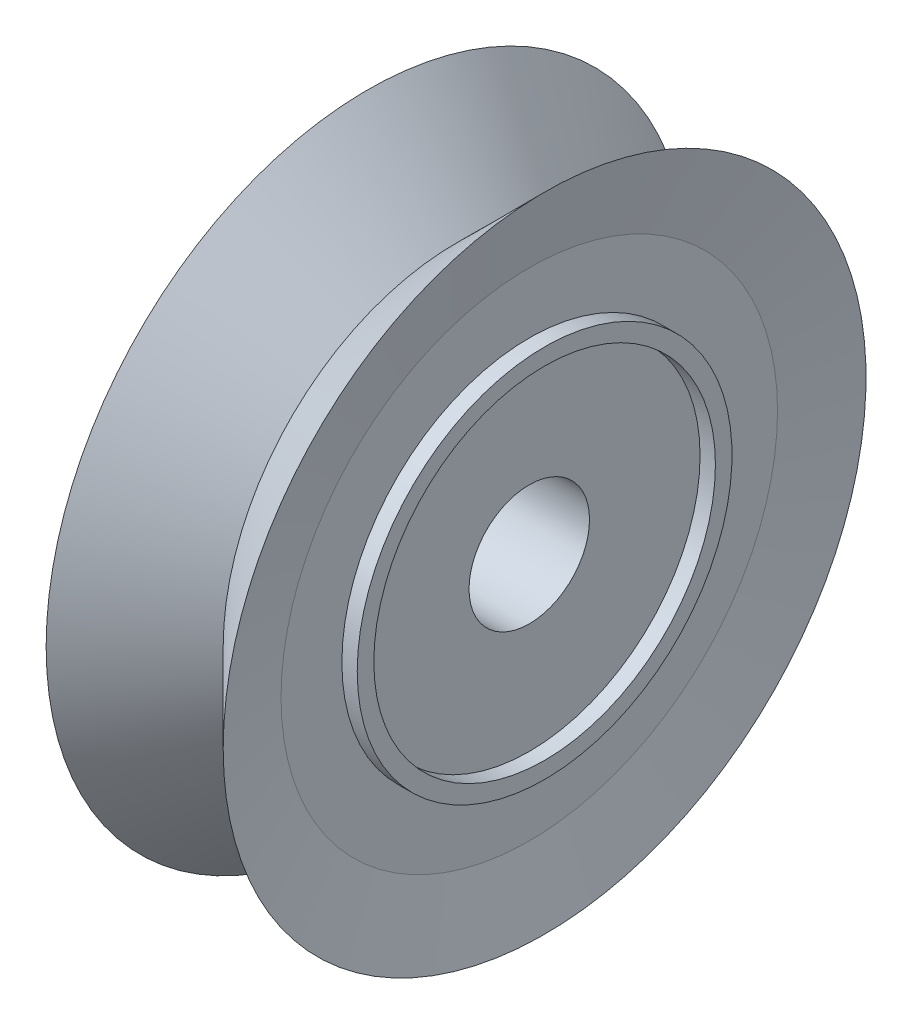
ISO-10303-21;
HEADER;
FILE_DESCRIPTION(('STEP AP214'),'2;1');
FILE_NAME('part.step','',(''),(''),'','','');
FILE_SCHEMA(('AUTOMOTIVE_DESIGN { 1 0 10303 214 1 1 1 1 }'));
ENDSEC;
DATA;
#1=APPLICATION_CONTEXT('core data for automotive mechanical design processes');
#2=APPLICATION_PROTOCOL_DEFINITION('international standard','automotive_design',2000,#1);
#3=PRODUCT_CONTEXT('',#1,'mechanical');
#4=PRODUCT('Part','Part','',(#3));
#5=PRODUCT_RELATED_PRODUCT_CATEGORY('part','',(#4));
#6=PRODUCT_DEFINITION_FORMATION('','',#4);
#7=PRODUCT_DEFINITION_CONTEXT('part definition',#1,'design');
#8=PRODUCT_DEFINITION('design','',#6,#7);
#9=PRODUCT_DEFINITION_SHAPE('','',#8);
#10=(LENGTH_UNIT() NAMED_UNIT(*) SI_UNIT(.MILLI.,.METRE.));
#11=(NAMED_UNIT(*) PLANE_ANGLE_UNIT() SI_UNIT($,.RADIAN.));
#12=(NAMED_UNIT(*) SI_UNIT($,.STERADIAN.) SOLID_ANGLE_UNIT());
#13=UNCERTAINTY_MEASURE_WITH_UNIT(LENGTH_MEASURE(1.E-05),#10,'distance_accuracy_value','');
#14=(GEOMETRIC_REPRESENTATION_CONTEXT(3) GLOBAL_UNCERTAINTY_ASSIGNED_CONTEXT((#13)) GLOBAL_UNIT_ASSIGNED_CONTEXT((#10,
#11,#12)) REPRESENTATION_CONTEXT('',''));
#15=CARTESIAN_POINT('',(0.,0.,0.));
#16=DIRECTION('',(0.,0.,1.));
#17=DIRECTION('',(1.,0.,0.));
#18=AXIS2_PLACEMENT_3D('',#15,#16,#17);
#19=CARTESIAN_POINT('',(-23.5677957656976,0.,-13.5627755997803));
#20=DIRECTION('',(1.,0.,0.));
#21=DIRECTION('',(0.,0.,-1.));
#22=AXIS2_PLACEMENT_3D('',#19,#20,#21);
#23=CONICAL_SURFACE('',#22,6.19514920305084,0.785398163397448);
#24=CARTESIAN_POINT('',(-25.2740444287008,0.,-13.5627755997803));
#25=DIRECTION('',(-1.,0.,0.));
#26=DIRECTION('',(0.,0.,1.));
#27=AXIS2_PLACEMENT_3D('',#24,#25,#26);
#28=CIRCLE('',#27,4.4889005400477);
#29=CARTESIAN_POINT('',(-25.2740444287008,0.,-9.07387505973255));
#30=VERTEX_POINT('',#29);
#31=EDGE_CURVE('E76',#30,#30,#28,.T.);
#32=ORIENTED_EDGE('',*,*,#31,.F.);
#33=EDGE_LOOP('',(#32));
#34=FACE_BOUND('',#33,.T.);
#35=CARTESIAN_POINT('',(-23.5677957656976,0.,-13.5627755997803));
#36=DIRECTION('',(-1.,0.,0.));
#37=DIRECTION('',(0.,0.,1.));
#38=AXIS2_PLACEMENT_3D('',#35,#36,#37);
#39=CIRCLE('',#38,6.19514920305084);
#40=CARTESIAN_POINT('',(-23.5677957656976,0.,-7.36762639672942));
#41=VERTEX_POINT('',#40);
#42=EDGE_CURVE('E10',#41,#41,#39,.T.);
#43=ORIENTED_EDGE('',*,*,#42,.T.);
#44=EDGE_LOOP('',(#43));
#45=FACE_BOUND('',#44,.T.);
#46=ADVANCED_FACE('F33',(#34,#45),#23,.T.);
#47=CARTESIAN_POINT('',(-23.5677957656976,0.,-13.5627755997803));
#48=DIRECTION('',(1.,0.,0.));
#49=DIRECTION('',(0.,0.,-1.));
#50=AXIS2_PLACEMENT_3D('',#47,#48,#49);
#51=CONICAL_SURFACE('',#50,6.19514920305084,1.36416338296937);
#52=CARTESIAN_POINT('',(-23.8634843338202,0.,-13.5627755997803));
#53=DIRECTION('',(-1.,0.,0.));
#54=DIRECTION('',(0.,0.,1.));
#55=AXIS2_PLACEMENT_3D('',#52,#53,#54);
#56=CIRCLE('',#55,4.78458910817031);
#57=CARTESIAN_POINT('',(-23.8634843338202,0.,-8.77818649160994));
#58=VERTEX_POINT('',#57);
#59=EDGE_CURVE('E39',#58,#58,#56,.T.);
#60=ORIENTED_EDGE('',*,*,#59,.T.);
#61=EDGE_LOOP('',(#60));
#62=FACE_BOUND('',#61,.T.);
#63=ORIENTED_EDGE('',*,*,#42,.F.);
#64=EDGE_LOOP('',(#63));
#65=FACE_BOUND('',#64,.T.);
#66=ADVANCED_FACE('F135',(#62,#65),#51,.F.);
#67=CARTESIAN_POINT('',(-23.8634843338202,0.,0.));
#68=DIRECTION('',(1.,0.,0.));
#69=DIRECTION('',(0.,0.,-1.));
#70=AXIS2_PLACEMENT_3D('',#67,#68,#69);
#71=PLANE('',#70);
#72=CARTESIAN_POINT('',(-23.8634843338202,0.,-13.5627755997803));
#73=DIRECTION('',(-1.,0.,0.));
#74=DIRECTION('',(0.,0.,1.));
#75=AXIS2_PLACEMENT_3D('',#72,#73,#74);
#76=CIRCLE('',#75,3.61174190269609);
#77=CARTESIAN_POINT('',(-23.8634843338202,0.,-9.95103369708416));
#78=VERTEX_POINT('',#77);
#79=EDGE_CURVE('E43',#78,#78,#76,.T.);
#80=ORIENTED_EDGE('',*,*,#79,.T.);
#81=EDGE_LOOP('',(#80));
#82=FACE_BOUND('',#81,.T.);
#83=ORIENTED_EDGE('',*,*,#59,.F.);
#84=EDGE_LOOP('',(#83));
#85=FACE_BOUND('',#84,.T.);
#86=ADVANCED_FACE('F140',(#82,#85),#71,.T.);
#87=CARTESIAN_POINT('',(-23.8634843338202,0.,-13.5627755997803));
#88=DIRECTION('',(-1.,0.,0.));
#89=DIRECTION('',(0.,0.,1.));
#90=AXIS2_PLACEMENT_3D('',#87,#88,#89);
#91=CYLINDRICAL_SURFACE('',#90,3.61174190269609);
#92=CARTESIAN_POINT('',(-23.5677957656976,0.,-13.5627755997803));
#93=DIRECTION('',(-1.,0.,0.));
#94=DIRECTION('',(0.,0.,1.));
#95=AXIS2_PLACEMENT_3D('',#92,#93,#94);
#96=CIRCLE('',#95,3.61174190269609);
#97=CARTESIAN_POINT('',(-23.5677957656976,0.,-9.95103369708416));
#98=VERTEX_POINT('',#97);
#99=EDGE_CURVE('E47',#98,#98,#96,.T.);
#100=ORIENTED_EDGE('',*,*,#99,.T.);
#101=EDGE_LOOP('',(#100));
#102=FACE_BOUND('',#101,.T.);
#103=ORIENTED_EDGE('',*,*,#79,.F.);
#104=EDGE_LOOP('',(#103));
#105=FACE_BOUND('',#104,.T.);
#106=ADVANCED_FACE('F145',(#102,#105),#91,.T.);
#107=CARTESIAN_POINT('',(-23.5677957656976,0.,0.));
#108=DIRECTION('',(1.,0.,0.));
#109=DIRECTION('',(0.,0.,-1.));
#110=AXIS2_PLACEMENT_3D('',#107,#108,#109);
#111=PLANE('',#110);
#112=CARTESIAN_POINT('',(-23.5677957656976,0.,-13.5627755997803));
#113=DIRECTION('',(-1.,0.,0.));
#114=DIRECTION('',(0.,0.,1.));
#115=AXIS2_PLACEMENT_3D('',#112,#113,#114);
#116=CIRCLE('',#115,3.29192884151118);
#117=CARTESIAN_POINT('',(-23.5677957656976,0.,-10.2708467582691));
#118=VERTEX_POINT('',#117);
#119=EDGE_CURVE('E52',#118,#118,#116,.T.);
#120=ORIENTED_EDGE('',*,*,#119,.T.);
#121=EDGE_LOOP('',(#120));
#122=FACE_BOUND('',#121,.T.);
#123=ORIENTED_EDGE('',*,*,#99,.F.);
#124=EDGE_LOOP('',(#123));
#125=FACE_BOUND('',#124,.T.);
#126=ADVANCED_FACE('F152',(#122,#125),#111,.T.);
#127=CARTESIAN_POINT('',(-23.8634843338202,0.,-13.5627755997803));
#128=DIRECTION('',(-1.,0.,0.));
#129=DIRECTION('',(0.,0.,1.));
#130=AXIS2_PLACEMENT_3D('',#127,#128,#129);
#131=CYLINDRICAL_SURFACE('',#130,3.29192884151118);
#132=CARTESIAN_POINT('',(-23.8634843338202,0.,-13.5627755997803));
#133=DIRECTION('',(-1.,0.,0.));
#134=DIRECTION('',(0.,0.,1.));
#135=AXIS2_PLACEMENT_3D('',#132,#133,#134);
#136=CIRCLE('',#135,3.29192884151118);
#137=CARTESIAN_POINT('',(-23.8634843338202,0.,-10.2708467582691));
#138=VERTEX_POINT('',#137);
#139=EDGE_CURVE('E55',#138,#138,#136,.T.);
#140=ORIENTED_EDGE('',*,*,#139,.T.);
#141=EDGE_LOOP('',(#140));
#142=FACE_BOUND('',#141,.T.);
#143=ORIENTED_EDGE('',*,*,#119,.F.);
#144=EDGE_LOOP('',(#143));
#145=FACE_BOUND('',#144,.T.);
#146=ADVANCED_FACE('F156',(#142,#145),#131,.F.);
#147=CARTESIAN_POINT('',(-23.8634843338202,0.,0.));
#148=DIRECTION('',(1.,0.,0.));
#149=DIRECTION('',(0.,0.,-1.));
#150=AXIS2_PLACEMENT_3D('',#147,#148,#149);
#151=PLANE('',#150);
#152=CARTESIAN_POINT('',(-23.8634843338202,0.,-13.5627755997803));
#153=DIRECTION('',(1.,0.,0.));
#154=DIRECTION('',(0.,0.,-1.));
#155=AXIS2_PLACEMENT_3D('',#152,#153,#154);
#156=CIRCLE('',#155,1.16077963846035);
#157=CARTESIAN_POINT('',(-23.8634843338202,0.,-14.7235552382406));
#158=VERTEX_POINT('',#157);
#159=EDGE_CURVE('E79',#158,#158,#156,.T.);
#160=ORIENTED_EDGE('',*,*,#159,.F.);
#161=EDGE_LOOP('',(#160));
#162=FACE_BOUND('',#161,.T.);
#163=ORIENTED_EDGE('',*,*,#139,.F.);
#164=EDGE_LOOP('',(#163));
#165=FACE_BOUND('',#164,.T.);
#166=ADVANCED_FACE('F92',(#162,#165),#151,.T.);
#167=CARTESIAN_POINT('',(-26.6846045235813,0.,0.));
#168=DIRECTION('',(1.,0.,0.));
#169=DIRECTION('',(0.,0.,-1.));
#170=AXIS2_PLACEMENT_3D('',#167,#168,#169);
#171=PLANE('',#170);
#172=CARTESIAN_POINT('',(-26.6846045235813,0.,-13.5627755997803));
#173=DIRECTION('',(-1.,0.,0.));
#174=DIRECTION('',(0.,0.,1.));
#175=AXIS2_PLACEMENT_3D('',#172,#173,#174);
#176=CIRCLE('',#175,1.16077963846035);
#177=CARTESIAN_POINT('',(-26.6846045235813,0.,-12.4019959613199));
#178=VERTEX_POINT('',#177);
#179=EDGE_CURVE('E82',#178,#178,#176,.T.);
#180=ORIENTED_EDGE('',*,*,#179,.F.);
#181=EDGE_LOOP('',(#180));
#182=FACE_BOUND('',#181,.T.);
#183=CARTESIAN_POINT('',(-26.6846045235813,0.,-13.5627755997803));
#184=DIRECTION('',(-1.,0.,0.));
#185=DIRECTION('',(0.,0.,1.));
#186=AXIS2_PLACEMENT_3D('',#183,#184,#185);
#187=CIRCLE('',#186,3.29192884151118);
#188=CARTESIAN_POINT('',(-26.6846045235813,0.,-10.2708467582691));
#189=VERTEX_POINT('',#188);
#190=EDGE_CURVE('E58',#189,#189,#187,.T.);
#191=ORIENTED_EDGE('',*,*,#190,.T.);
#192=EDGE_LOOP('',(#191));
#193=FACE_BOUND('',#192,.T.);
#194=ADVANCED_FACE('F88',(#182,#193),#171,.F.);
#195=CARTESIAN_POINT('',(-23.8634843338202,0.,-13.5627755997803));
#196=DIRECTION('',(-1.,0.,0.));
#197=DIRECTION('',(0.,0.,1.));
#198=AXIS2_PLACEMENT_3D('',#195,#196,#197);
#199=CYLINDRICAL_SURFACE('',#198,3.29192884151118);
#200=ORIENTED_EDGE('',*,*,#190,.F.);
#201=EDGE_LOOP('',(#200));
#202=FACE_BOUND('',#201,.T.);
#203=CARTESIAN_POINT('',(-26.9802930917039,0.,-13.5627755997803));
#204=DIRECTION('',(-1.,0.,0.));
#205=DIRECTION('',(0.,0.,1.));
#206=AXIS2_PLACEMENT_3D('',#203,#204,#205);
#207=CIRCLE('',#206,3.29192884151118);
#208=CARTESIAN_POINT('',(-26.9802930917039,0.,-10.2708467582691));
#209=VERTEX_POINT('',#208);
#210=EDGE_CURVE('E61',#209,#209,#207,.T.);
#211=ORIENTED_EDGE('',*,*,#210,.T.);
#212=EDGE_LOOP('',(#211));
#213=FACE_BOUND('',#212,.T.);
#214=ADVANCED_FACE('F91',(#202,#213),#199,.F.);
#215=CARTESIAN_POINT('',(-26.9802930917039,0.,0.));
#216=DIRECTION('',(1.,0.,0.));
#217=DIRECTION('',(0.,0.,-1.));
#218=AXIS2_PLACEMENT_3D('',#215,#216,#217);
#219=PLANE('',#218);
#220=ORIENTED_EDGE('',*,*,#210,.F.);
#221=EDGE_LOOP('',(#220));
#222=FACE_BOUND('',#221,.T.);
#223=CARTESIAN_POINT('',(-26.9802930917039,0.,-13.5627755997803));
#224=DIRECTION('',(-1.,0.,0.));
#225=DIRECTION('',(0.,0.,1.));
#226=AXIS2_PLACEMENT_3D('',#223,#224,#225);
#227=CIRCLE('',#226,3.61174190269609);
#228=CARTESIAN_POINT('',(-26.9802930917039,0.,-9.95103369708416));
#229=VERTEX_POINT('',#228);
#230=EDGE_CURVE('E64',#229,#229,#227,.T.);
#231=ORIENTED_EDGE('',*,*,#230,.T.);
#232=EDGE_LOOP('',(#231));
#233=FACE_BOUND('',#232,.T.);
#234=ADVANCED_FACE('F98',(#222,#233),#219,.F.);
#235=CARTESIAN_POINT('',(-23.8634843338202,0.,-13.5627755997803));
#236=DIRECTION('',(-1.,0.,0.));
#237=DIRECTION('',(0.,0.,1.));
#238=AXIS2_PLACEMENT_3D('',#235,#236,#237);
#239=CYLINDRICAL_SURFACE('',#238,3.61174190269609);
#240=ORIENTED_EDGE('',*,*,#230,.F.);
#241=EDGE_LOOP('',(#240));
#242=FACE_BOUND('',#241,.T.);
#243=CARTESIAN_POINT('',(-26.6846045235813,0.,-13.5627755997803));
#244=DIRECTION('',(-1.,0.,0.));
#245=DIRECTION('',(0.,0.,1.));
#246=AXIS2_PLACEMENT_3D('',#243,#244,#245);
#247=CIRCLE('',#246,3.61174190269609);
#248=CARTESIAN_POINT('',(-26.6846045235813,0.,-9.95103369708416));
#249=VERTEX_POINT('',#248);
#250=EDGE_CURVE('E67',#249,#249,#247,.T.);
#251=ORIENTED_EDGE('',*,*,#250,.T.);
#252=EDGE_LOOP('',(#251));
#253=FACE_BOUND('',#252,.T.);
#254=ADVANCED_FACE('F104',(#242,#253),#239,.T.);
#255=CARTESIAN_POINT('',(-26.6846045235813,0.,0.));
#256=DIRECTION('',(1.,0.,0.));
#257=DIRECTION('',(0.,0.,-1.));
#258=AXIS2_PLACEMENT_3D('',#255,#256,#257);
#259=PLANE('',#258);
#260=ORIENTED_EDGE('',*,*,#250,.F.);
#261=EDGE_LOOP('',(#260));
#262=FACE_BOUND('',#261,.T.);
#263=CARTESIAN_POINT('',(-26.6846045235813,0.,-13.5627755997803));
#264=DIRECTION('',(-1.,0.,0.));
#265=DIRECTION('',(0.,0.,1.));
#266=AXIS2_PLACEMENT_3D('',#263,#264,#265);
#267=CIRCLE('',#266,4.78458910817031);
#268=CARTESIAN_POINT('',(-26.6846045235813,0.,-8.77818649160994));
#269=VERTEX_POINT('',#268);
#270=EDGE_CURVE('E70',#269,#269,#267,.T.);
#271=ORIENTED_EDGE('',*,*,#270,.T.);
#272=EDGE_LOOP('',(#271));
#273=FACE_BOUND('',#272,.T.);
#274=ADVANCED_FACE('F110',(#262,#273),#259,.F.);
#275=CARTESIAN_POINT('',(-26.9802930917039,0.,-13.5627755997803));
#276=DIRECTION('',(-1.,0.,0.));
#277=DIRECTION('',(0.,0.,1.));
#278=AXIS2_PLACEMENT_3D('',#275,#276,#277);
#279=CONICAL_SURFACE('',#278,6.19514920305084,1.36416338296937);
#280=ORIENTED_EDGE('',*,*,#270,.F.);
#281=EDGE_LOOP('',(#280));
#282=FACE_BOUND('',#281,.T.);
#283=CARTESIAN_POINT('',(-26.9802930917039,0.,-13.5627755997803));
#284=DIRECTION('',(-1.,0.,0.));
#285=DIRECTION('',(0.,0.,1.));
#286=AXIS2_PLACEMENT_3D('',#283,#284,#285);
#287=CIRCLE('',#286,6.19514920305084);
#288=CARTESIAN_POINT('',(-26.9802930917039,0.,-7.36762639672942));
#289=VERTEX_POINT('',#288);
#290=EDGE_CURVE('E73',#289,#289,#287,.T.);
#291=ORIENTED_EDGE('',*,*,#290,.T.);
#292=EDGE_LOOP('',(#291));
#293=FACE_BOUND('',#292,.T.);
#294=ADVANCED_FACE('F116',(#282,#293),#279,.F.);
#295=CARTESIAN_POINT('',(-26.9802930917039,0.,-13.5627755997803));
#296=DIRECTION('',(-1.,0.,0.));
#297=DIRECTION('',(0.,0.,1.));
#298=AXIS2_PLACEMENT_3D('',#295,#296,#297);
#299=CONICAL_SURFACE('',#298,6.19514920305084,0.785398163397449);
#300=ORIENTED_EDGE('',*,*,#31,.T.);
#301=EDGE_LOOP('',(#300));
#302=FACE_BOUND('',#301,.T.);
#303=ORIENTED_EDGE('',*,*,#290,.F.);
#304=EDGE_LOOP('',(#303));
#305=FACE_BOUND('',#304,.T.);
#306=ADVANCED_FACE('F122',(#302,#305),#299,.T.);
#307=CARTESIAN_POINT('',(-19.0646045235813,0.,-13.5627755997803));
#308=DIRECTION('',(-1.,0.,0.));
#309=DIRECTION('',(0.,0.,1.));
#310=AXIS2_PLACEMENT_3D('',#307,#308,#309);
#311=CYLINDRICAL_SURFACE('',#310,1.16077963846035);
#312=ORIENTED_EDGE('',*,*,#159,.T.);
#313=EDGE_LOOP('',(#312));
#314=FACE_BOUND('',#313,.T.);
#315=ORIENTED_EDGE('',*,*,#179,.T.);
#316=EDGE_LOOP('',(#315));
#317=FACE_BOUND('',#316,.T.);
#318=ADVANCED_FACE('F86',(#314,#317),#311,.F.);
#319=CLOSED_SHELL('',(#46,#66,#86,#106,#126,#146,#166,#194,#214,#234,#254,#274,#294,#306,#318));
#320=MANIFOLD_SOLID_BREP('B2',#319);
#321=ADVANCED_BREP_SHAPE_REPRESENTATION('',(#18,#320),#14);
#322=SHAPE_DEFINITION_REPRESENTATION(#9,#321);
ENDSEC;
END-ISO-10303-21;
